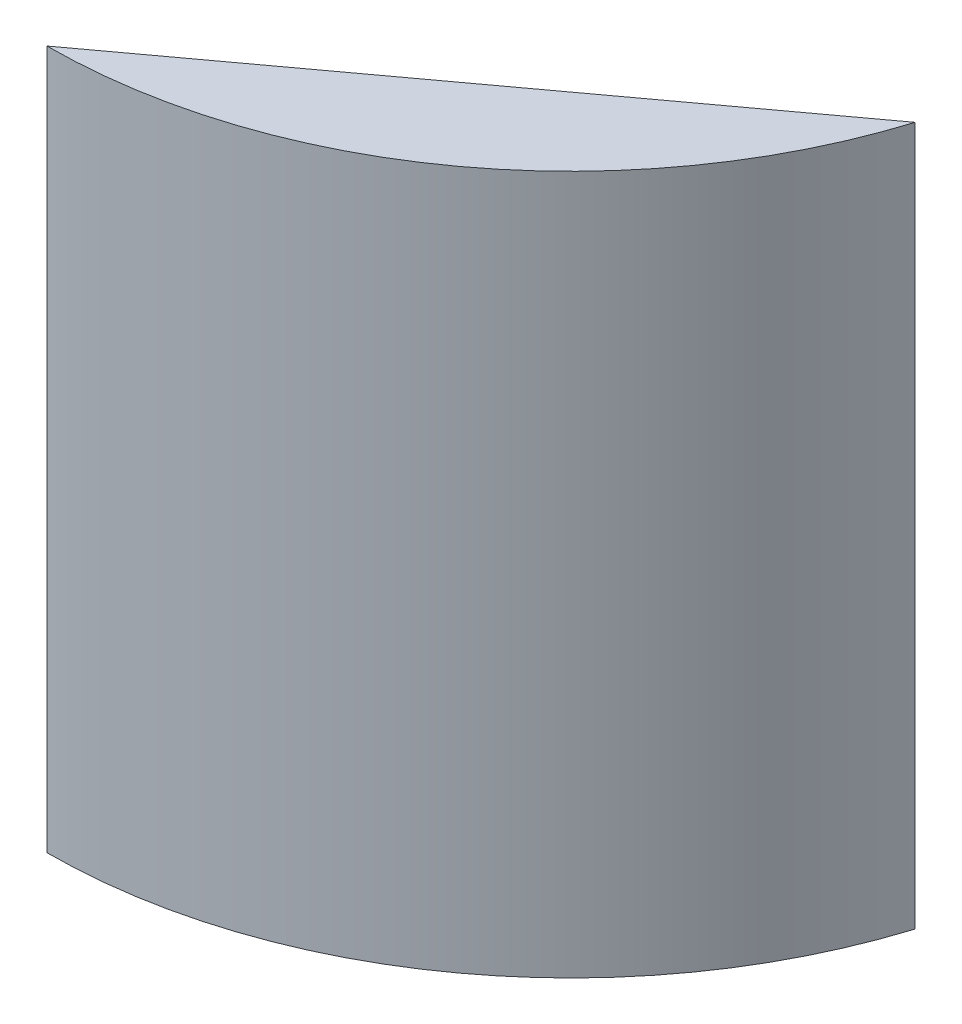
ISO-10303-21;
HEADER;
FILE_DESCRIPTION(('STEP AP214'),'2;1');
FILE_NAME('part.step','',(''),(''),'','','');
FILE_SCHEMA(('AUTOMOTIVE_DESIGN { 1 0 10303 214 1 1 1 1 }'));
ENDSEC;
DATA;
#1=APPLICATION_CONTEXT('core data for automotive mechanical design processes');
#2=APPLICATION_PROTOCOL_DEFINITION('international standard','automotive_design',2000,#1);
#3=PRODUCT_CONTEXT('',#1,'mechanical');
#4=PRODUCT('Part','Part','',(#3));
#5=PRODUCT_RELATED_PRODUCT_CATEGORY('part','',(#4));
#6=PRODUCT_DEFINITION_FORMATION('','',#4);
#7=PRODUCT_DEFINITION_CONTEXT('part definition',#1,'design');
#8=PRODUCT_DEFINITION('design','',#6,#7);
#9=PRODUCT_DEFINITION_SHAPE('','',#8);
#10=(LENGTH_UNIT() NAMED_UNIT(*) SI_UNIT(.MILLI.,.METRE.));
#11=(NAMED_UNIT(*) PLANE_ANGLE_UNIT() SI_UNIT($,.RADIAN.));
#12=(NAMED_UNIT(*) SI_UNIT($,.STERADIAN.) SOLID_ANGLE_UNIT());
#13=UNCERTAINTY_MEASURE_WITH_UNIT(LENGTH_MEASURE(1.E-05),#10,'distance_accuracy_value','');
#14=(GEOMETRIC_REPRESENTATION_CONTEXT(3) GLOBAL_UNCERTAINTY_ASSIGNED_CONTEXT((#13)) GLOBAL_UNIT_ASSIGNED_CONTEXT((#10,
#11,#12)) REPRESENTATION_CONTEXT('',''));
#15=CARTESIAN_POINT('',(0.,0.,0.));
#16=DIRECTION('',(0.,0.,1.));
#17=DIRECTION('',(1.,0.,0.));
#18=AXIS2_PLACEMENT_3D('',#15,#16,#17);
#19=CARTESIAN_POINT('',(0.,114.3,0.));
#20=DIRECTION('',(0.,-1.,0.));
#21=DIRECTION('',(0.,0.,-1.));
#22=AXIS2_PLACEMENT_3D('',#19,#20,#21);
#23=CYLINDRICAL_SURFACE('',#22,85.725);
#24=CARTESIAN_POINT('',(0.,114.3,0.));
#25=DIRECTION('',(0.,1.,0.));
#26=DIRECTION('',(0.,0.,1.));
#27=AXIS2_PLACEMENT_3D('',#24,#25,#26);
#28=CIRCLE('',#27,85.725);
#29=CARTESIAN_POINT('',(0.,114.3,85.725));
#30=VERTEX_POINT('',#29);
#31=CARTESIAN_POINT('',(81.8390377098757,114.3,25.5175925925926));
#32=VERTEX_POINT('',#31);
#33=EDGE_CURVE('E45',#30,#32,#28,.T.);
#34=ORIENTED_EDGE('',*,*,#33,.F.);
#35=DIRECTION('',(0.,1.,0.));
#36=VECTOR('',#35,1.);
#37=CARTESIAN_POINT('',(0.,-38.1,85.725));
#38=LINE('',#37,#36);
#39=CARTESIAN_POINT('',(0.,0.,85.725));
#40=VERTEX_POINT('',#39);
#41=EDGE_CURVE('E59',#40,#30,#38,.T.);
#42=ORIENTED_EDGE('',*,*,#41,.F.);
#43=CARTESIAN_POINT('',(0.,0.,0.));
#44=DIRECTION('',(0.,1.,0.));
#45=DIRECTION('',(0.,0.,1.));
#46=AXIS2_PLACEMENT_3D('',#43,#44,#45);
#47=CIRCLE('',#46,85.725);
#48=CARTESIAN_POINT('',(81.8390377098757,0.,25.5175925925926));
#49=VERTEX_POINT('',#48);
#50=EDGE_CURVE('E73',#40,#49,#47,.T.);
#51=ORIENTED_EDGE('',*,*,#50,.T.);
#52=DIRECTION('',(0.,1.,0.));
#53=VECTOR('',#52,1.);
#54=CARTESIAN_POINT('',(81.8390377098757,-38.1,25.5175925925926));
#55=LINE('',#54,#53);
#56=EDGE_CURVE('E52',#49,#32,#55,.T.);
#57=ORIENTED_EDGE('',*,*,#56,.T.);
#58=EDGE_LOOP('',(#34,#42,#51,#57));
#59=FACE_BOUND('',#58,.T.);
#60=ADVANCED_FACE('F38',(#59),#23,.T.);
#61=CARTESIAN_POINT('',(0.,114.3,0.));
#62=DIRECTION('',(0.,1.,0.));
#63=DIRECTION('',(0.,0.,1.));
#64=AXIS2_PLACEMENT_3D('',#61,#62,#63);
#65=PLANE('',#64);
#66=DIRECTION('',(0.805502339664131,0.,-0.592592592592593));
#67=VECTOR('',#66,1.);
#68=CARTESIAN_POINT('',(0.,114.3,85.725));
#69=LINE('',#68,#67);
#70=EDGE_CURVE('E62',#30,#32,#69,.T.);
#71=ORIENTED_EDGE('',*,*,#70,.F.);
#72=ORIENTED_EDGE('',*,*,#33,.T.);
#73=EDGE_LOOP('',(#71,#72));
#74=FACE_BOUND('',#73,.T.);
#75=ADVANCED_FACE('F70',(#74),#65,.T.);
#76=CARTESIAN_POINT('',(0.,0.,0.));
#77=DIRECTION('',(0.,1.,0.));
#78=DIRECTION('',(0.,0.,1.));
#79=AXIS2_PLACEMENT_3D('',#76,#77,#78);
#80=PLANE('',#79);
#81=CARTESIAN_POINT('',(45.8597594274689,0.,62.336492182002));
#82=DIRECTION('',(0.,-1.,0.));
#83=DIRECTION('',(0.,0.,-1.));
#84=AXIS2_PLACEMENT_3D('',#81,#82,#83);
#85=CIRCLE('',#84,5.588);
#86=CARTESIAN_POINT('',(45.8597594274689,0.,56.748492182002));
#87=VERTEX_POINT('',#86);
#88=EDGE_CURVE('E101',#87,#87,#85,.T.);
#89=ORIENTED_EDGE('',*,*,#88,.F.);
#90=EDGE_LOOP('',(#89));
#91=FACE_BOUND('',#90,.T.);
#92=ORIENTED_EDGE('',*,*,#50,.F.);
#93=DIRECTION('',(0.805502339664131,0.,-0.592592592592593));
#94=VECTOR('',#93,1.);
#95=CARTESIAN_POINT('',(40.9195188549379,0.,55.6212962962963));
#96=LINE('',#95,#94);
#97=EDGE_CURVE('E11',#40,#49,#96,.T.);
#98=ORIENTED_EDGE('',*,*,#97,.T.);
#99=EDGE_LOOP('',(#92,#98));
#100=FACE_BOUND('',#99,.T.);
#101=ADVANCED_FACE('F116',(#91,#100),#80,.F.);
#102=CARTESIAN_POINT('',(0.,-38.1,85.725));
#103=DIRECTION('',(0.592592592592593,0.,0.805502339664131));
#104=DIRECTION('',(0.805502339664131,0.,-0.592592592592593));
#105=AXIS2_PLACEMENT_3D('',#102,#103,#104);
#106=PLANE('',#105);
#107=CARTESIAN_POINT('',(18.4137834847221,104.14,72.1783333333334));
#108=DIRECTION('',(-0.592592592592593,0.,-0.805502339664131));
#109=DIRECTION('',(-0.805502339664131,0.,0.592592592592593));
#110=AXIS2_PLACEMENT_3D('',#107,#108,#109);
#111=CIRCLE('',#110,2.778125);
#112=CARTESIAN_POINT('',(16.1759972973426,104.14,73.8246296296297));
#113=VERTEX_POINT('',#112);
#114=EDGE_CURVE('E90',#113,#113,#111,.T.);
#115=ORIENTED_EDGE('',*,*,#114,.F.);
#116=EDGE_LOOP('',(#115));
#117=FACE_BOUND('',#116,.T.);
#118=CARTESIAN_POINT('',(38.873542912191,27.94,57.1264814814815));
#119=DIRECTION('',(-0.592592592592593,0.,-0.805502339664131));
#120=DIRECTION('',(-0.805502339664131,0.,0.592592592592593));
#121=AXIS2_PLACEMENT_3D('',#118,#119,#120);
#122=CIRCLE('',#121,2.778125);
#123=CARTESIAN_POINT('',(36.6357567248116,27.94,58.7727777777778));
#124=VERTEX_POINT('',#123);
#125=EDGE_CURVE('E83',#124,#124,#122,.T.);
#126=ORIENTED_EDGE('',*,*,#125,.F.);
#127=EDGE_LOOP('',(#126));
#128=FACE_BOUND('',#127,.T.);
#129=CARTESIAN_POINT('',(18.4137834847221,27.94,72.1783333333334));
#130=DIRECTION('',(-0.592592592592593,0.,-0.805502339664131));
#131=DIRECTION('',(-0.805502339664131,0.,0.592592592592593));
#132=AXIS2_PLACEMENT_3D('',#129,#130,#131);
#133=CIRCLE('',#132,2.77812500000001);
#134=CARTESIAN_POINT('',(16.1759972973426,27.94,73.8246296296297));
#135=VERTEX_POINT('',#134);
#136=EDGE_CURVE('E95',#135,#135,#133,.T.);
#137=ORIENTED_EDGE('',*,*,#136,.F.);
#138=EDGE_LOOP('',(#137));
#139=FACE_BOUND('',#138,.T.);
#140=CARTESIAN_POINT('',(38.873542912191,104.14,57.1264814814815));
#141=DIRECTION('',(-0.592592592592593,0.,-0.805502339664131));
#142=DIRECTION('',(-0.805502339664131,0.,0.592592592592593));
#143=AXIS2_PLACEMENT_3D('',#140,#141,#142);
#144=CIRCLE('',#143,2.778125);
#145=CARTESIAN_POINT('',(36.6357567248116,104.14,58.7727777777778));
#146=VERTEX_POINT('',#145);
#147=EDGE_CURVE('E77',#146,#146,#144,.T.);
#148=ORIENTED_EDGE('',*,*,#147,.F.);
#149=EDGE_LOOP('',(#148));
#150=FACE_BOUND('',#149,.T.);
#151=ORIENTED_EDGE('',*,*,#41,.T.);
#152=ORIENTED_EDGE('',*,*,#70,.T.);
#153=ORIENTED_EDGE('',*,*,#56,.F.);
#154=ORIENTED_EDGE('',*,*,#97,.F.);
#155=EDGE_LOOP('',(#151,#152,#153,#154));
#156=FACE_BOUND('',#155,.T.);
#157=ADVANCED_FACE('F61',(#117,#128,#139,#150,#156),#106,.F.);
#158=CARTESIAN_POINT('',(43.5772466158947,104.14,63.5201563025656));
#159=DIRECTION('',(-0.592592592592593,0.,-0.805502339664131));
#160=DIRECTION('',(-0.805502339664131,0.,0.592592592592593));
#161=AXIS2_PLACEMENT_3D('',#158,#159,#160);
#162=CYLINDRICAL_SURFACE('',#161,2.778125);
#163=CARTESIAN_POINT('',(43.5772466158947,104.14,63.5201563025656));
#164=DIRECTION('',(-0.592592592592593,0.,-0.805502339664131));
#165=DIRECTION('',(-0.805502339664131,0.,0.592592592592593));
#166=AXIS2_PLACEMENT_3D('',#163,#164,#165);
#167=CIRCLE('',#166,2.778125);
#168=CARTESIAN_POINT('',(41.3394604285153,104.14,65.1664525988619));
#169=VERTEX_POINT('',#168);
#170=EDGE_CURVE('E71',#169,#169,#167,.T.);
#171=ORIENTED_EDGE('',*,*,#170,.F.);
#172=EDGE_LOOP('',(#171));
#173=FACE_BOUND('',#172,.T.);
#174=ORIENTED_EDGE('',*,*,#147,.T.);
#175=EDGE_LOOP('',(#174));
#176=FACE_BOUND('',#175,.T.);
#177=ADVANCED_FACE('F123',(#173,#176),#162,.F.);
#178=CARTESIAN_POINT('',(43.5772466158947,104.14,63.5201563025656));
#179=DIRECTION('',(-0.592592592592593,0.,-0.805502339664131));
#180=DIRECTION('',(-0.805502339664131,0.,0.592592592592593));
#181=AXIS2_PLACEMENT_3D('',#178,#179,#180);
#182=PLANE('',#181);
#183=ORIENTED_EDGE('',*,*,#170,.T.);
#184=EDGE_LOOP('',(#183));
#185=FACE_BOUND('',#184,.T.);
#186=ADVANCED_FACE('F150',(#185),#182,.T.);
#187=CARTESIAN_POINT('',(23.1174871884258,27.94,78.5720081544174));
#188=DIRECTION('',(-0.592592592592593,0.,-0.805502339664131));
#189=DIRECTION('',(-0.805502339664131,0.,0.592592592592593));
#190=AXIS2_PLACEMENT_3D('',#187,#188,#189);
#191=CYLINDRICAL_SURFACE('',#190,2.77812500000001);
#192=CARTESIAN_POINT('',(23.1174871884258,27.94,78.5720081544174));
#193=DIRECTION('',(-0.592592592592593,0.,-0.805502339664131));
#194=DIRECTION('',(-0.805502339664131,0.,0.592592592592593));
#195=AXIS2_PLACEMENT_3D('',#192,#193,#194);
#196=CIRCLE('',#195,2.77812500000001);
#197=CARTESIAN_POINT('',(20.8797010010463,27.94,80.2183044507137));
#198=VERTEX_POINT('',#197);
#199=EDGE_CURVE('E87',#198,#198,#196,.T.);
#200=ORIENTED_EDGE('',*,*,#199,.F.);
#201=EDGE_LOOP('',(#200));
#202=FACE_BOUND('',#201,.T.);
#203=ORIENTED_EDGE('',*,*,#136,.T.);
#204=EDGE_LOOP('',(#203));
#205=FACE_BOUND('',#204,.T.);
#206=ADVANCED_FACE('F160',(#202,#205),#191,.F.);
#207=CARTESIAN_POINT('',(23.1174871884258,27.94,78.5720081544174));
#208=DIRECTION('',(-0.592592592592593,0.,-0.805502339664131));
#209=DIRECTION('',(-0.805502339664131,0.,0.592592592592593));
#210=AXIS2_PLACEMENT_3D('',#207,#208,#209);
#211=PLANE('',#210);
#212=ORIENTED_EDGE('',*,*,#199,.T.);
#213=EDGE_LOOP('',(#212));
#214=FACE_BOUND('',#213,.T.);
#215=ADVANCED_FACE('F170',(#214),#211,.T.);
#216=CARTESIAN_POINT('',(43.5772466158947,27.94,63.5201563025656));
#217=DIRECTION('',(-0.592592592592593,0.,-0.805502339664131));
#218=DIRECTION('',(-0.805502339664131,0.,0.592592592592593));
#219=AXIS2_PLACEMENT_3D('',#216,#217,#218);
#220=CYLINDRICAL_SURFACE('',#219,2.778125);
#221=CARTESIAN_POINT('',(43.5772466158947,27.94,63.5201563025656));
#222=DIRECTION('',(-0.592592592592593,0.,-0.805502339664131));
#223=DIRECTION('',(-0.805502339664131,0.,0.592592592592593));
#224=AXIS2_PLACEMENT_3D('',#221,#222,#223);
#225=CIRCLE('',#224,2.778125);
#226=CARTESIAN_POINT('',(41.3394604285153,27.94,65.1664525988619));
#227=VERTEX_POINT('',#226);
#228=EDGE_CURVE('E86',#227,#227,#225,.T.);
#229=ORIENTED_EDGE('',*,*,#228,.F.);
#230=EDGE_LOOP('',(#229));
#231=FACE_BOUND('',#230,.T.);
#232=ORIENTED_EDGE('',*,*,#125,.T.);
#233=EDGE_LOOP('',(#232));
#234=FACE_BOUND('',#233,.T.);
#235=ADVANCED_FACE('F180',(#231,#234),#220,.F.);
#236=CARTESIAN_POINT('',(43.5772466158947,27.94,63.5201563025656));
#237=DIRECTION('',(-0.592592592592593,0.,-0.805502339664131));
#238=DIRECTION('',(-0.805502339664131,0.,0.592592592592593));
#239=AXIS2_PLACEMENT_3D('',#236,#237,#238);
#240=PLANE('',#239);
#241=ORIENTED_EDGE('',*,*,#228,.T.);
#242=EDGE_LOOP('',(#241));
#243=FACE_BOUND('',#242,.T.);
#244=ADVANCED_FACE('F190',(#243),#240,.T.);
#245=CARTESIAN_POINT('',(23.1174871884258,104.14,78.5720081544174));
#246=DIRECTION('',(-0.592592592592593,0.,-0.805502339664131));
#247=DIRECTION('',(-0.805502339664131,0.,0.592592592592593));
#248=AXIS2_PLACEMENT_3D('',#245,#246,#247);
#249=CYLINDRICAL_SURFACE('',#248,2.778125);
#250=CARTESIAN_POINT('',(23.1174871884258,104.14,78.5720081544174));
#251=DIRECTION('',(-0.592592592592593,0.,-0.805502339664131));
#252=DIRECTION('',(-0.805502339664131,0.,0.592592592592593));
#253=AXIS2_PLACEMENT_3D('',#250,#251,#252);
#254=CIRCLE('',#253,2.778125);
#255=CARTESIAN_POINT('',(20.8797010010463,104.14,80.2183044507137));
#256=VERTEX_POINT('',#255);
#257=EDGE_CURVE('E80',#256,#256,#254,.T.);
#258=ORIENTED_EDGE('',*,*,#257,.F.);
#259=EDGE_LOOP('',(#258));
#260=FACE_BOUND('',#259,.T.);
#261=ORIENTED_EDGE('',*,*,#114,.T.);
#262=EDGE_LOOP('',(#261));
#263=FACE_BOUND('',#262,.T.);
#264=ADVANCED_FACE('F200',(#260,#263),#249,.F.);
#265=CARTESIAN_POINT('',(23.1174871884258,104.14,78.5720081544174));
#266=DIRECTION('',(-0.592592592592593,0.,-0.805502339664131));
#267=DIRECTION('',(-0.805502339664131,0.,0.592592592592593));
#268=AXIS2_PLACEMENT_3D('',#265,#266,#267);
#269=PLANE('',#268);
#270=ORIENTED_EDGE('',*,*,#257,.T.);
#271=EDGE_LOOP('',(#270));
#272=FACE_BOUND('',#271,.T.);
#273=ADVANCED_FACE('F112',(#272),#269,.T.);
#274=CARTESIAN_POINT('',(45.8597594274689,6.096,62.336492182002));
#275=DIRECTION('',(0.,-1.,0.));
#276=DIRECTION('',(0.,0.,-1.));
#277=AXIS2_PLACEMENT_3D('',#274,#275,#276);
#278=CYLINDRICAL_SURFACE('',#277,5.588);
#279=CARTESIAN_POINT('',(45.8597594274689,6.096,62.336492182002));
#280=DIRECTION('',(0.,-1.,0.));
#281=DIRECTION('',(0.,0.,-1.));
#282=AXIS2_PLACEMENT_3D('',#279,#280,#281);
#283=CIRCLE('',#282,5.588);
#284=CARTESIAN_POINT('',(45.8597594274689,6.096,56.748492182002));
#285=VERTEX_POINT('',#284);
#286=EDGE_CURVE('E98',#285,#285,#283,.T.);
#287=ORIENTED_EDGE('',*,*,#286,.F.);
#288=EDGE_LOOP('',(#287));
#289=FACE_BOUND('',#288,.T.);
#290=ORIENTED_EDGE('',*,*,#88,.T.);
#291=EDGE_LOOP('',(#290));
#292=FACE_BOUND('',#291,.T.);
#293=ADVANCED_FACE('F109',(#289,#292),#278,.F.);
#294=CARTESIAN_POINT('',(45.8597594274689,6.096,62.336492182002));
#295=DIRECTION('',(0.,-1.,0.));
#296=DIRECTION('',(0.,0.,-1.));
#297=AXIS2_PLACEMENT_3D('',#294,#295,#296);
#298=PLANE('',#297);
#299=ORIENTED_EDGE('',*,*,#286,.T.);
#300=EDGE_LOOP('',(#299));
#301=FACE_BOUND('',#300,.T.);
#302=ADVANCED_FACE('F107',(#301),#298,.T.);
#303=CLOSED_SHELL('',(#60,#75,#101,#157,#177,#186,#206,#215,#235,#244,#264,#273,#293,#302));
#304=MANIFOLD_SOLID_BREP('B2',#303);
#305=ADVANCED_BREP_SHAPE_REPRESENTATION('',(#18,#304),#14);
#306=SHAPE_DEFINITION_REPRESENTATION(#9,#305);
ENDSEC;
END-ISO-10303-21;
